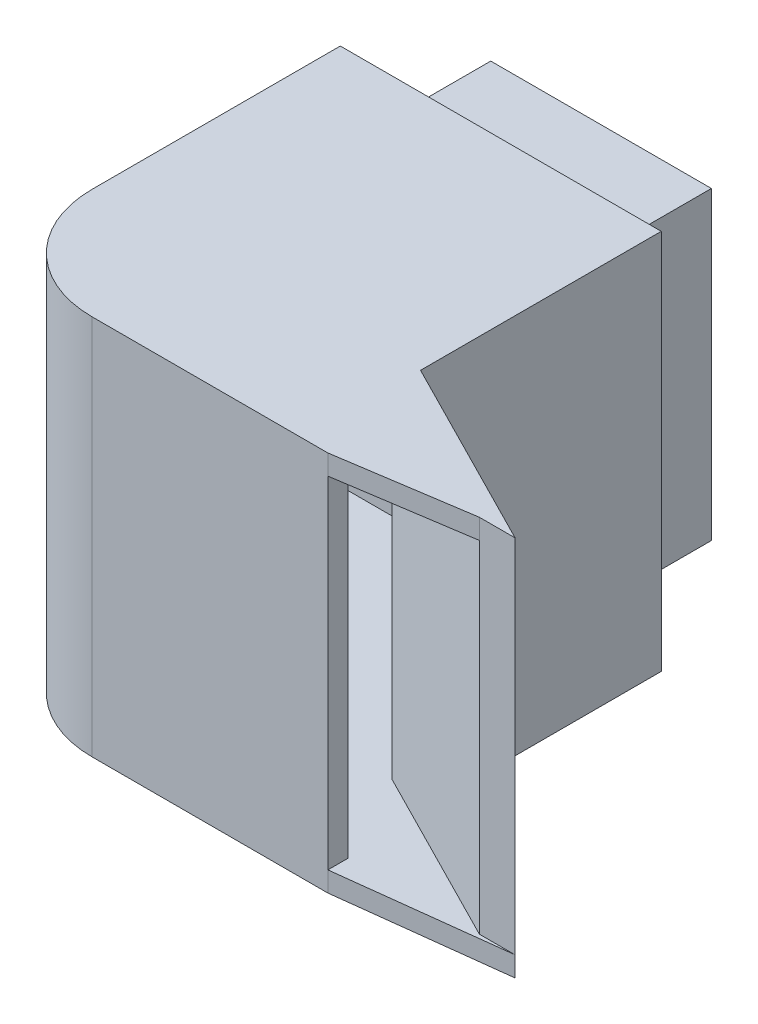
ISO-10303-21;
HEADER;
FILE_DESCRIPTION(('STEP AP214'),'2;1');
FILE_NAME('part.step','',(''),(''),'','','');
FILE_SCHEMA(('AUTOMOTIVE_DESIGN { 1 0 10303 214 1 1 1 1 }'));
ENDSEC;
DATA;
#1=APPLICATION_CONTEXT('core data for automotive mechanical design processes');
#2=APPLICATION_PROTOCOL_DEFINITION('international standard','automotive_design',2000,#1);
#3=PRODUCT_CONTEXT('',#1,'mechanical');
#4=PRODUCT('Part','Part','',(#3));
#5=PRODUCT_RELATED_PRODUCT_CATEGORY('part','',(#4));
#6=PRODUCT_DEFINITION_FORMATION('','',#4);
#7=PRODUCT_DEFINITION_CONTEXT('part definition',#1,'design');
#8=PRODUCT_DEFINITION('design','',#6,#7);
#9=PRODUCT_DEFINITION_SHAPE('','',#8);
#10=(LENGTH_UNIT() NAMED_UNIT(*) SI_UNIT(.MILLI.,.METRE.));
#11=(NAMED_UNIT(*) PLANE_ANGLE_UNIT() SI_UNIT($,.RADIAN.));
#12=(NAMED_UNIT(*) SI_UNIT($,.STERADIAN.) SOLID_ANGLE_UNIT());
#13=UNCERTAINTY_MEASURE_WITH_UNIT(LENGTH_MEASURE(1.E-05),#10,'distance_accuracy_value','');
#14=(GEOMETRIC_REPRESENTATION_CONTEXT(3) GLOBAL_UNCERTAINTY_ASSIGNED_CONTEXT((#13)) GLOBAL_UNIT_ASSIGNED_CONTEXT((#10,
#11,#12)) REPRESENTATION_CONTEXT('',''));
#15=CARTESIAN_POINT('',(0.,0.,0.));
#16=DIRECTION('',(0.,0.,1.));
#17=DIRECTION('',(1.,0.,0.));
#18=AXIS2_PLACEMENT_3D('',#15,#16,#17);
#19=CARTESIAN_POINT('',(-13.0014433254994,19.,-4.91100049947791));
#20=DIRECTION('',(0.,0.,1.));
#21=DIRECTION('',(1.,0.,0.));
#22=AXIS2_PLACEMENT_3D('',#19,#20,#21);
#23=PLANE('',#22);
#24=DIRECTION('',(-1.,0.,0.));
#25=VECTOR('',#24,1.);
#26=CARTESIAN_POINT('',(-13.0014433254994,0.,-4.91100049947791));
#27=LINE('',#26,#25);
#28=CARTESIAN_POINT('',(-13.0014433254994,0.,-4.91100049947791));
#29=VERTEX_POINT('',#28);
#30=CARTESIAN_POINT('',(-29.0014433254994,0.,-4.91100049947791));
#31=VERTEX_POINT('',#30);
#32=EDGE_CURVE('E314',#29,#31,#27,.T.);
#33=ORIENTED_EDGE('',*,*,#32,.T.);
#34=DIRECTION('',(0.,-1.,0.));
#35=VECTOR('',#34,1.);
#36=CARTESIAN_POINT('',(-29.0014433254994,19.,-4.91100049947791));
#37=LINE('',#36,#35);
#38=CARTESIAN_POINT('',(-29.0014433254994,19.,-4.91100049947791));
#39=VERTEX_POINT('',#38);
#40=EDGE_CURVE('E11',#39,#31,#37,.T.);
#41=ORIENTED_EDGE('',*,*,#40,.F.);
#42=DIRECTION('',(-1.,0.,0.));
#43=VECTOR('',#42,1.);
#44=CARTESIAN_POINT('',(-13.0014433254994,19.,-4.91100049947791));
#45=LINE('',#44,#43);
#46=CARTESIAN_POINT('',(-13.0014433254994,19.,-4.91100049947791));
#47=VERTEX_POINT('',#46);
#48=EDGE_CURVE('E315',#47,#39,#45,.T.);
#49=ORIENTED_EDGE('',*,*,#48,.F.);
#50=DIRECTION('',(0.,-1.,0.));
#51=VECTOR('',#50,1.);
#52=CARTESIAN_POINT('',(-13.0014433254994,19.,-4.91100049947791));
#53=LINE('',#52,#51);
#54=EDGE_CURVE('E332',#47,#29,#53,.T.);
#55=ORIENTED_EDGE('',*,*,#54,.T.);
#56=EDGE_LOOP('',(#33,#41,#49,#55));
#57=FACE_BOUND('',#56,.T.);
#58=DIRECTION('',(0.,-1.,0.));
#59=VECTOR('',#58,1.);
#60=CARTESIAN_POINT('',(-15.5014433254994,17.1,-4.91100049947791));
#61=LINE('',#60,#59);
#62=CARTESIAN_POINT('',(-15.5014433254994,17.1,-4.91100049947791));
#63=VERTEX_POINT('',#62);
#64=CARTESIAN_POINT('',(-15.5014433254994,1.9,-4.91100049947791));
#65=VERTEX_POINT('',#64);
#66=EDGE_CURVE('E204',#63,#65,#61,.T.);
#67=ORIENTED_EDGE('',*,*,#66,.F.);
#68=DIRECTION('',(1.,0.,0.));
#69=VECTOR('',#68,1.);
#70=CARTESIAN_POINT('',(-26.5014433254994,17.1,-4.91100049947791));
#71=LINE('',#70,#69);
#72=CARTESIAN_POINT('',(-26.5014433254994,17.1,-4.91100049947791));
#73=VERTEX_POINT('',#72);
#74=EDGE_CURVE('E238',#73,#63,#71,.T.);
#75=ORIENTED_EDGE('',*,*,#74,.F.);
#76=DIRECTION('',(0.,1.,0.));
#77=VECTOR('',#76,1.);
#78=CARTESIAN_POINT('',(-26.5014433254994,17.1,-4.91100049947791));
#79=LINE('',#78,#77);
#80=CARTESIAN_POINT('',(-26.5014433254994,1.90000000000001,-4.91100049947791));
#81=VERTEX_POINT('',#80);
#82=EDGE_CURVE('E248',#81,#73,#79,.T.);
#83=ORIENTED_EDGE('',*,*,#82,.F.);
#84=DIRECTION('',(-1.,0.,0.));
#85=VECTOR('',#84,1.);
#86=CARTESIAN_POINT('',(-26.5014433254994,1.9,-4.91100049947791));
#87=LINE('',#86,#85);
#88=EDGE_CURVE('E57',#65,#81,#87,.T.);
#89=ORIENTED_EDGE('',*,*,#88,.F.);
#90=EDGE_LOOP('',(#67,#75,#83,#89));
#91=FACE_BOUND('',#90,.T.);
#92=ADVANCED_FACE('F35',(#57,#91),#23,.F.);
#93=CARTESIAN_POINT('',(-11.7428727049855,19.,12.9666829371132));
#94=DIRECTION('',(-1.,0.,0.));
#95=DIRECTION('',(0.,0.,1.));
#96=AXIS2_PLACEMENT_3D('',#93,#94,#95);
#97=PLANE('',#96);
#98=DIRECTION('',(0.,0.,1.));
#99=VECTOR('',#98,1.);
#100=CARTESIAN_POINT('',(-11.7428727049855,1.,12.9666829371132));
#101=LINE('',#100,#99);
#102=CARTESIAN_POINT('',(-11.7428727049855,1.,11.9666829371132));
#103=VERTEX_POINT('',#102);
#104=CARTESIAN_POINT('',(-11.7428727049855,1.,12.9666829371132));
#105=VERTEX_POINT('',#104);
#106=EDGE_CURVE('E286',#103,#105,#101,.T.);
#107=ORIENTED_EDGE('',*,*,#106,.F.);
#108=DIRECTION('',(0.,-1.,0.));
#109=VECTOR('',#108,1.);
#110=CARTESIAN_POINT('',(-11.7428727049855,19.,11.9666829371132));
#111=LINE('',#110,#109);
#112=CARTESIAN_POINT('',(-11.7428727049855,18.,11.9666829371132));
#113=VERTEX_POINT('',#112);
#114=EDGE_CURVE('E374',#113,#103,#111,.T.);
#115=ORIENTED_EDGE('',*,*,#114,.F.);
#116=DIRECTION('',(0.,0.,1.));
#117=VECTOR('',#116,1.);
#118=CARTESIAN_POINT('',(-11.7428727049855,18.,12.9666829371132));
#119=LINE('',#118,#117);
#120=CARTESIAN_POINT('',(-11.7428727049855,18.,12.9666829371132));
#121=VERTEX_POINT('',#120);
#122=EDGE_CURVE('E311',#113,#121,#119,.T.);
#123=ORIENTED_EDGE('',*,*,#122,.T.);
#124=DIRECTION('',(0.,-1.,0.));
#125=VECTOR('',#124,1.);
#126=CARTESIAN_POINT('',(-11.7428727049855,19.,12.9666829371132));
#127=LINE('',#126,#125);
#128=EDGE_CURVE('E377',#121,#105,#127,.T.);
#129=ORIENTED_EDGE('',*,*,#128,.T.);
#130=EDGE_LOOP('',(#107,#115,#123,#129));
#131=FACE_BOUND('',#130,.T.);
#132=ADVANCED_FACE('F455',(#131),#97,.F.);
#133=CARTESIAN_POINT('',(-11.7428727049855,19.,11.9666829371132));
#134=DIRECTION('',(0.,0.,1.));
#135=DIRECTION('',(1.,0.,0.));
#136=AXIS2_PLACEMENT_3D('',#133,#134,#135);
#137=PLANE('',#136);
#138=DIRECTION('',(1.,0.,0.));
#139=VECTOR('',#138,1.);
#140=CARTESIAN_POINT('',(-11.7428727049855,1.,11.9666829371132));
#141=LINE('',#140,#139);
#142=CARTESIAN_POINT('',(-23.4876050559901,1.,11.9666829371132));
#143=VERTEX_POINT('',#142);
#144=EDGE_CURVE('E284',#143,#103,#141,.T.);
#145=ORIENTED_EDGE('',*,*,#144,.F.);
#146=DIRECTION('',(0.,-1.,0.));
#147=VECTOR('',#146,1.);
#148=CARTESIAN_POINT('',(-23.4876050559901,19.,11.9666829371132));
#149=LINE('',#148,#147);
#150=CARTESIAN_POINT('',(-23.4876050559901,18.,11.9666829371132));
#151=VERTEX_POINT('',#150);
#152=EDGE_CURVE('E371',#151,#143,#149,.T.);
#153=ORIENTED_EDGE('',*,*,#152,.F.);
#154=DIRECTION('',(1.,0.,0.));
#155=VECTOR('',#154,1.);
#156=CARTESIAN_POINT('',(-11.7428727049855,18.,11.9666829371132));
#157=LINE('',#156,#155);
#158=EDGE_CURVE('E308',#151,#113,#157,.T.);
#159=ORIENTED_EDGE('',*,*,#158,.T.);
#160=ORIENTED_EDGE('',*,*,#114,.T.);
#161=EDGE_LOOP('',(#145,#153,#159,#160));
#162=FACE_BOUND('',#161,.T.);
#163=ADVANCED_FACE('F451',(#162),#137,.F.);
#164=CARTESIAN_POINT('',(-23.4876050559901,19.,7.45284466760389));
#165=DIRECTION('',(0.,-1.,0.));
#166=DIRECTION('',(0.,0.,-1.));
#167=AXIS2_PLACEMENT_3D('',#164,#165,#166);
#168=CYLINDRICAL_SURFACE('',#167,4.51383826950932);
#169=CARTESIAN_POINT('',(-23.4876050559901,1.,7.45284466760389));
#170=DIRECTION('',(0.,-1.,0.));
#171=DIRECTION('',(0.,0.,-1.));
#172=AXIS2_PLACEMENT_3D('',#169,#170,#171);
#173=CIRCLE('',#172,4.51383826950932);
#174=CARTESIAN_POINT('',(-28.0014433254994,1.,7.45284466760389));
#175=VERTEX_POINT('',#174);
#176=EDGE_CURVE('E282',#175,#143,#173,.F.);
#177=ORIENTED_EDGE('',*,*,#176,.F.);
#178=DIRECTION('',(0.,-1.,0.));
#179=VECTOR('',#178,1.);
#180=CARTESIAN_POINT('',(-28.0014433254994,19.,7.45284466760389));
#181=LINE('',#180,#179);
#182=CARTESIAN_POINT('',(-28.0014433254994,18.,7.45284466760389));
#183=VERTEX_POINT('',#182);
#184=EDGE_CURVE('E368',#183,#175,#181,.T.);
#185=ORIENTED_EDGE('',*,*,#184,.F.);
#186=CARTESIAN_POINT('',(-23.4876050559901,18.,7.45284466760389));
#187=DIRECTION('',(0.,-1.,0.));
#188=DIRECTION('',(0.,0.,-1.));
#189=AXIS2_PLACEMENT_3D('',#186,#187,#188);
#190=CIRCLE('',#189,4.51383826950932);
#191=EDGE_CURVE('E305',#183,#151,#190,.F.);
#192=ORIENTED_EDGE('',*,*,#191,.T.);
#193=ORIENTED_EDGE('',*,*,#152,.T.);
#194=EDGE_LOOP('',(#177,#185,#192,#193));
#195=FACE_BOUND('',#194,.T.);
#196=ADVANCED_FACE('F448',(#195),#168,.F.);
#197=CARTESIAN_POINT('',(-28.0014433254994,19.,7.45284466760389));
#198=DIRECTION('',(-1.,0.,0.));
#199=DIRECTION('',(0.,0.,1.));
#200=AXIS2_PLACEMENT_3D('',#197,#198,#199);
#201=PLANE('',#200);
#202=DIRECTION('',(0.,0.,1.));
#203=VECTOR('',#202,1.);
#204=CARTESIAN_POINT('',(-28.0014433254994,1.,7.45284466760389));
#205=LINE('',#204,#203);
#206=CARTESIAN_POINT('',(-28.0014433254994,1.,-3.91100049947791));
#207=VERTEX_POINT('',#206);
#208=EDGE_CURVE('E280',#207,#175,#205,.T.);
#209=ORIENTED_EDGE('',*,*,#208,.F.);
#210=DIRECTION('',(0.,-1.,0.));
#211=VECTOR('',#210,1.);
#212=CARTESIAN_POINT('',(-28.0014433254994,19.,-3.91100049947791));
#213=LINE('',#212,#211);
#214=CARTESIAN_POINT('',(-28.0014433254994,18.,-3.91100049947791));
#215=VERTEX_POINT('',#214);
#216=EDGE_CURVE('E365',#215,#207,#213,.T.);
#217=ORIENTED_EDGE('',*,*,#216,.F.);
#218=DIRECTION('',(0.,0.,1.));
#219=VECTOR('',#218,1.);
#220=CARTESIAN_POINT('',(-28.0014433254994,18.,7.45284466760389));
#221=LINE('',#220,#219);
#222=EDGE_CURVE('E302',#215,#183,#221,.T.);
#223=ORIENTED_EDGE('',*,*,#222,.T.);
#224=ORIENTED_EDGE('',*,*,#184,.T.);
#225=EDGE_LOOP('',(#209,#217,#223,#224));
#226=FACE_BOUND('',#225,.T.);
#227=ADVANCED_FACE('F443',(#226),#201,.F.);
#228=CARTESIAN_POINT('',(-28.0014433254994,19.,-3.91100049947791));
#229=DIRECTION('',(0.,0.,-1.));
#230=DIRECTION('',(-1.,0.,0.));
#231=AXIS2_PLACEMENT_3D('',#228,#229,#230);
#232=PLANE('',#231);
#233=DIRECTION('',(-1.,0.,0.));
#234=VECTOR('',#233,1.);
#235=CARTESIAN_POINT('',(-28.0014433254994,2.9,-3.91100049947791));
#236=LINE('',#235,#234);
#237=CARTESIAN_POINT('',(-16.5014433254994,2.9,-3.9110004994779));
#238=VERTEX_POINT('',#237);
#239=CARTESIAN_POINT('',(-25.5014433254994,2.9,-3.9110004994779));
#240=VERTEX_POINT('',#239);
#241=EDGE_CURVE('E216',#238,#240,#236,.T.);
#242=ORIENTED_EDGE('',*,*,#241,.T.);
#243=DIRECTION('',(0.,1.,0.));
#244=VECTOR('',#243,1.);
#245=CARTESIAN_POINT('',(-25.5014433254994,19.,-3.91100049947791));
#246=LINE('',#245,#244);
#247=CARTESIAN_POINT('',(-25.5014433254994,16.1,-3.9110004994779));
#248=VERTEX_POINT('',#247);
#249=EDGE_CURVE('E199',#240,#248,#246,.T.);
#250=ORIENTED_EDGE('',*,*,#249,.T.);
#251=DIRECTION('',(1.,0.,0.));
#252=VECTOR('',#251,1.);
#253=CARTESIAN_POINT('',(-28.0014433254994,16.1,-3.91100049947791));
#254=LINE('',#253,#252);
#255=CARTESIAN_POINT('',(-16.5014433254994,16.1,-3.91100049947791));
#256=VERTEX_POINT('',#255);
#257=EDGE_CURVE('E207',#248,#256,#254,.T.);
#258=ORIENTED_EDGE('',*,*,#257,.T.);
#259=DIRECTION('',(0.,-1.,0.));
#260=VECTOR('',#259,1.);
#261=CARTESIAN_POINT('',(-16.5014433254994,19.,-3.91100049947791));
#262=LINE('',#261,#260);
#263=EDGE_CURVE('E211',#256,#238,#262,.T.);
#264=ORIENTED_EDGE('',*,*,#263,.T.);
#265=EDGE_LOOP('',(#242,#250,#258,#264));
#266=FACE_BOUND('',#265,.T.);
#267=DIRECTION('',(-1.,0.,0.));
#268=VECTOR('',#267,1.);
#269=CARTESIAN_POINT('',(-28.0014433254994,1.,-3.91100049947791));
#270=LINE('',#269,#268);
#271=CARTESIAN_POINT('',(-14.0670678807808,1.,-3.91100049947791));
#272=VERTEX_POINT('',#271);
#273=EDGE_CURVE('E278',#272,#207,#270,.T.);
#274=ORIENTED_EDGE('',*,*,#273,.F.);
#275=DIRECTION('',(0.,-1.,0.));
#276=VECTOR('',#275,1.);
#277=CARTESIAN_POINT('',(-14.0670678807808,19.,-3.91100049947791));
#278=LINE('',#277,#276);
#279=CARTESIAN_POINT('',(-14.0670678807808,18.,-3.91100049947791));
#280=VERTEX_POINT('',#279);
#281=EDGE_CURVE('E362',#280,#272,#278,.T.);
#282=ORIENTED_EDGE('',*,*,#281,.F.);
#283=DIRECTION('',(-1.,0.,0.));
#284=VECTOR('',#283,1.);
#285=CARTESIAN_POINT('',(-28.0014433254994,18.,-3.91100049947791));
#286=LINE('',#285,#284);
#287=EDGE_CURVE('E299',#280,#215,#286,.T.);
#288=ORIENTED_EDGE('',*,*,#287,.T.);
#289=ORIENTED_EDGE('',*,*,#216,.T.);
#290=EDGE_LOOP('',(#274,#282,#288,#289));
#291=FACE_BOUND('',#290,.T.);
#292=ADVANCED_FACE('F213',(#266,#291),#232,.F.);
#293=CARTESIAN_POINT('',(-14.0670678807808,19.,-3.91100049947791));
#294=DIRECTION('',(1.,0.,0.));
#295=DIRECTION('',(0.,0.,-1.));
#296=AXIS2_PLACEMENT_3D('',#293,#294,#295);
#297=PLANE('',#296);
#298=DIRECTION('',(0.,0.,-1.));
#299=VECTOR('',#298,1.);
#300=CARTESIAN_POINT('',(-14.0670678807808,1.,-3.91100049947791));
#301=LINE('',#300,#299);
#302=CARTESIAN_POINT('',(-14.0670678807808,1.,7.45284466760389));
#303=VERTEX_POINT('',#302);
#304=EDGE_CURVE('E276',#303,#272,#301,.T.);
#305=ORIENTED_EDGE('',*,*,#304,.F.);
#306=DIRECTION('',(0.,-1.,0.));
#307=VECTOR('',#306,1.);
#308=CARTESIAN_POINT('',(-14.0670678807808,19.,7.45284466760389));
#309=LINE('',#308,#307);
#310=CARTESIAN_POINT('',(-14.0670678807808,18.,7.45284466760389));
#311=VERTEX_POINT('',#310);
#312=EDGE_CURVE('E359',#311,#303,#309,.T.);
#313=ORIENTED_EDGE('',*,*,#312,.F.);
#314=DIRECTION('',(0.,0.,-1.));
#315=VECTOR('',#314,1.);
#316=CARTESIAN_POINT('',(-14.0670678807808,18.,-3.91100049947791));
#317=LINE('',#316,#315);
#318=EDGE_CURVE('E296',#311,#280,#317,.T.);
#319=ORIENTED_EDGE('',*,*,#318,.T.);
#320=ORIENTED_EDGE('',*,*,#281,.T.);
#321=EDGE_LOOP('',(#305,#313,#319,#320));
#322=FACE_BOUND('',#321,.T.);
#323=ADVANCED_FACE('F437',(#322),#297,.F.);
#324=CARTESIAN_POINT('',(-14.0670678807808,19.,7.45284466760389));
#325=DIRECTION('',(0.453246735020218,0.,-0.891385100387881));
#326=DIRECTION('',(-0.891385100387881,0.,-0.453246735020218));
#327=AXIS2_PLACEMENT_3D('',#324,#325,#326);
#328=PLANE('',#327);
#329=DIRECTION('',(-0.891385100387881,0.,-0.453246735020218));
#330=VECTOR('',#329,1.);
#331=CARTESIAN_POINT('',(-14.0670678807808,1.,7.45284466760389));
#332=LINE('',#331,#330);
#333=CARTESIAN_POINT('',(-5.18985406296535,1.,11.9666829371132));
#334=VERTEX_POINT('',#333);
#335=EDGE_CURVE('E274',#334,#303,#332,.T.);
#336=ORIENTED_EDGE('',*,*,#335,.F.);
#337=DIRECTION('',(0.,-1.,0.));
#338=VECTOR('',#337,1.);
#339=CARTESIAN_POINT('',(-5.18985406296535,19.,11.9666829371132));
#340=LINE('',#339,#338);
#341=CARTESIAN_POINT('',(-5.18985406296535,18.,11.9666829371132));
#342=VERTEX_POINT('',#341);
#343=EDGE_CURVE('E355',#342,#334,#340,.T.);
#344=ORIENTED_EDGE('',*,*,#343,.F.);
#345=DIRECTION('',(-0.891385100387881,0.,-0.453246735020218));
#346=VECTOR('',#345,1.);
#347=CARTESIAN_POINT('',(-14.0670678807808,18.,7.45284466760389));
#348=LINE('',#347,#346);
#349=EDGE_CURVE('E291',#342,#311,#348,.T.);
#350=ORIENTED_EDGE('',*,*,#349,.T.);
#351=ORIENTED_EDGE('',*,*,#312,.T.);
#352=EDGE_LOOP('',(#336,#344,#350,#351));
#353=FACE_BOUND('',#352,.T.);
#354=ADVANCED_FACE('F433',(#353),#328,.F.);
#355=CARTESIAN_POINT('',(-5.18985406296535,19.,11.9666829371132));
#356=DIRECTION('',(0.,0.,-1.));
#357=DIRECTION('',(-1.,0.,0.));
#358=AXIS2_PLACEMENT_3D('',#355,#356,#357);
#359=PLANE('',#358);
#360=DIRECTION('',(-1.,0.,0.));
#361=VECTOR('',#360,1.);
#362=CARTESIAN_POINT('',(-5.18985406296535,1.,11.9666829371132));
#363=LINE('',#362,#361);
#364=CARTESIAN_POINT('',(-3.40866746227748,1.,11.9666829371132));
#365=VERTEX_POINT('',#364);
#366=EDGE_CURVE('E270',#365,#334,#363,.T.);
#367=ORIENTED_EDGE('',*,*,#366,.F.);
#368=DIRECTION('',(0.,-1.,0.));
#369=VECTOR('',#368,1.);
#370=CARTESIAN_POINT('',(-3.40866746227748,19.,11.9666829371132));
#371=LINE('',#370,#369);
#372=CARTESIAN_POINT('',(-3.40866746227748,19.,11.9666829371132));
#373=VERTEX_POINT('',#372);
#374=EDGE_CURVE('E352',#373,#365,#371,.T.);
#375=ORIENTED_EDGE('',*,*,#374,.F.);
#376=DIRECTION('',(1.,0.,0.));
#377=VECTOR('',#376,1.);
#378=CARTESIAN_POINT('',(-5.18985406296535,19.,11.9666829371132));
#379=LINE('',#378,#377);
#380=CARTESIAN_POINT('',(-5.18985406296535,19.,11.9666829371132));
#381=VERTEX_POINT('',#380);
#382=EDGE_CURVE('E326',#381,#373,#379,.T.);
#383=ORIENTED_EDGE('',*,*,#382,.F.);
#384=EDGE_CURVE('E356',#381,#342,#340,.T.);
#385=ORIENTED_EDGE('',*,*,#384,.T.);
#386=ORIENTED_EDGE('',*,*,#343,.T.);
#387=EDGE_LOOP('',(#367,#375,#383,#385,#386));
#388=FACE_BOUND('',#387,.T.);
#389=ADVANCED_FACE('F426',(#388),#359,.F.);
#390=CARTESIAN_POINT('',(-29.0014433254994,19.,-4.91100049947791));
#391=DIRECTION('',(1.,0.,0.));
#392=DIRECTION('',(0.,0.,-1.));
#393=AXIS2_PLACEMENT_3D('',#390,#391,#392);
#394=PLANE('',#393);
#395=DIRECTION('',(0.,0.,1.));
#396=VECTOR('',#395,1.);
#397=CARTESIAN_POINT('',(-29.0014433254994,0.,-4.91100049947791));
#398=LINE('',#397,#396);
#399=CARTESIAN_POINT('',(-29.0014433254994,0.,7.45983090895021));
#400=VERTEX_POINT('',#399);
#401=EDGE_CURVE('E335',#31,#400,#398,.T.);
#402=ORIENTED_EDGE('',*,*,#401,.T.);
#403=DIRECTION('',(0.,-1.,0.));
#404=VECTOR('',#403,1.);
#405=CARTESIAN_POINT('',(-29.0014433254994,19.,7.45983090895021));
#406=LINE('',#405,#404);
#407=CARTESIAN_POINT('',(-29.0014433254994,19.,7.45983090895021));
#408=VERTEX_POINT('',#407);
#409=EDGE_CURVE('E42',#408,#400,#406,.T.);
#410=ORIENTED_EDGE('',*,*,#409,.F.);
#411=DIRECTION('',(0.,0.,1.));
#412=VECTOR('',#411,1.);
#413=CARTESIAN_POINT('',(-29.0014433254994,19.,-4.91100049947791));
#414=LINE('',#413,#412);
#415=EDGE_CURVE('E318',#39,#408,#414,.T.);
#416=ORIENTED_EDGE('',*,*,#415,.F.);
#417=ORIENTED_EDGE('',*,*,#40,.T.);
#418=EDGE_LOOP('',(#402,#410,#416,#417));
#419=FACE_BOUND('',#418,.T.);
#420=ADVANCED_FACE('F390',(#419),#394,.F.);
#421=CARTESIAN_POINT('',(-23.4945912973364,19.,7.45983090895021));
#422=DIRECTION('',(0.,-1.,0.));
#423=DIRECTION('',(0.,0.,-1.));
#424=AXIS2_PLACEMENT_3D('',#421,#422,#423);
#425=CYLINDRICAL_SURFACE('',#424,5.506852028163);
#426=CARTESIAN_POINT('',(-23.4945912973364,0.,7.45983090895021));
#427=DIRECTION('',(0.,1.,0.));
#428=DIRECTION('',(0.,0.,1.));
#429=AXIS2_PLACEMENT_3D('',#426,#427,#428);
#430=CIRCLE('',#429,5.506852028163);
#431=CARTESIAN_POINT('',(-23.4945912973364,0.,12.9666829371132));
#432=VERTEX_POINT('',#431);
#433=EDGE_CURVE('E338',#400,#432,#430,.T.);
#434=ORIENTED_EDGE('',*,*,#433,.T.);
#435=DIRECTION('',(0.,-1.,0.));
#436=VECTOR('',#435,1.);
#437=CARTESIAN_POINT('',(-23.4945912973364,19.,12.9666829371132));
#438=LINE('',#437,#436);
#439=CARTESIAN_POINT('',(-23.4945912973364,19.,12.9666829371132));
#440=VERTEX_POINT('',#439);
#441=EDGE_CURVE('E380',#440,#432,#438,.T.);
#442=ORIENTED_EDGE('',*,*,#441,.F.);
#443=CARTESIAN_POINT('',(-23.4945912973364,19.,7.45983090895021));
#444=DIRECTION('',(0.,1.,0.));
#445=DIRECTION('',(0.,0.,1.));
#446=AXIS2_PLACEMENT_3D('',#443,#444,#445);
#447=CIRCLE('',#446,5.506852028163);
#448=EDGE_CURVE('E321',#408,#440,#447,.T.);
#449=ORIENTED_EDGE('',*,*,#448,.F.);
#450=ORIENTED_EDGE('',*,*,#409,.T.);
#451=EDGE_LOOP('',(#434,#442,#449,#450));
#452=FACE_BOUND('',#451,.T.);
#453=ADVANCED_FACE('F384',(#452),#425,.T.);
#454=CARTESIAN_POINT('',(-23.4945912973364,19.,12.9666829371132));
#455=DIRECTION('',(0.,0.,-1.));
#456=DIRECTION('',(-1.,0.,0.));
#457=AXIS2_PLACEMENT_3D('',#454,#455,#456);
#458=PLANE('',#457);
#459=DIRECTION('',(0.,-1.,0.));
#460=VECTOR('',#459,1.);
#461=CARTESIAN_POINT('',(-11.7428727049855,1.,12.9666829371132));
#462=LINE('',#461,#460);
#463=CARTESIAN_POINT('',(-11.7428727049855,0.,12.9666829371132));
#464=VERTEX_POINT('',#463);
#465=EDGE_CURVE('E268',#105,#464,#462,.T.);
#466=ORIENTED_EDGE('',*,*,#465,.F.);
#467=ORIENTED_EDGE('',*,*,#128,.F.);
#468=CARTESIAN_POINT('',(-11.7428727049855,19.,12.9666829371132));
#469=VERTEX_POINT('',#468);
#470=EDGE_CURVE('E378',#469,#121,#127,.T.);
#471=ORIENTED_EDGE('',*,*,#470,.F.);
#472=DIRECTION('',(1.,0.,0.));
#473=VECTOR('',#472,1.);
#474=CARTESIAN_POINT('',(-23.4945912973364,19.,12.9666829371132));
#475=LINE('',#474,#473);
#476=EDGE_CURVE('E323',#440,#469,#475,.T.);
#477=ORIENTED_EDGE('',*,*,#476,.F.);
#478=ORIENTED_EDGE('',*,*,#441,.T.);
#479=DIRECTION('',(1.,0.,0.));
#480=VECTOR('',#479,1.);
#481=CARTESIAN_POINT('',(-23.4945912973364,0.,12.9666829371132));
#482=LINE('',#481,#480);
#483=EDGE_CURVE('E341',#432,#464,#482,.T.);
#484=ORIENTED_EDGE('',*,*,#483,.T.);
#485=EDGE_LOOP('',(#466,#467,#471,#477,#478,#484));
#486=FACE_BOUND('',#485,.T.);
#487=ADVANCED_FACE('F399',(#486),#458,.F.);
#488=CARTESIAN_POINT('',(-13.0014433254994,19.,7.08899950052209));
#489=DIRECTION('',(-0.453246735020218,0.,0.891385100387881));
#490=DIRECTION('',(0.891385100387881,0.,0.453246735020218));
#491=AXIS2_PLACEMENT_3D('',#488,#489,#490);
#492=PLANE('',#491);
#493=DIRECTION('',(-0.891385100387881,0.,-0.453246735020218));
#494=VECTOR('',#493,1.);
#495=CARTESIAN_POINT('',(-13.0014433254994,0.,7.08899950052209));
#496=LINE('',#495,#494);
#497=CARTESIAN_POINT('',(-3.40866746227748,0.,11.9666829371132));
#498=VERTEX_POINT('',#497);
#499=CARTESIAN_POINT('',(-13.0014433254994,0.,7.08899950052209));
#500=VERTEX_POINT('',#499);
#501=EDGE_CURVE('E344',#498,#500,#496,.T.);
#502=ORIENTED_EDGE('',*,*,#501,.T.);
#503=DIRECTION('',(0.,-1.,0.));
#504=VECTOR('',#503,1.);
#505=CARTESIAN_POINT('',(-13.0014433254994,19.,7.08899950052209));
#506=LINE('',#505,#504);
#507=CARTESIAN_POINT('',(-13.0014433254994,19.,7.08899950052209));
#508=VERTEX_POINT('',#507);
#509=EDGE_CURVE('E350',#508,#500,#506,.T.);
#510=ORIENTED_EDGE('',*,*,#509,.F.);
#511=DIRECTION('',(-0.891385100387881,0.,-0.453246735020218));
#512=VECTOR('',#511,1.);
#513=CARTESIAN_POINT('',(-13.0014433254994,19.,7.08899950052209));
#514=LINE('',#513,#512);
#515=EDGE_CURVE('E328',#373,#508,#514,.T.);
#516=ORIENTED_EDGE('',*,*,#515,.F.);
#517=ORIENTED_EDGE('',*,*,#374,.T.);
#518=DIRECTION('',(0.,-1.,0.));
#519=VECTOR('',#518,1.);
#520=CARTESIAN_POINT('',(-3.40866746227748,1.,11.9666829371132));
#521=LINE('',#520,#519);
#522=EDGE_CURVE('E266',#365,#498,#521,.T.);
#523=ORIENTED_EDGE('',*,*,#522,.T.);
#524=EDGE_LOOP('',(#502,#510,#516,#517,#523));
#525=FACE_BOUND('',#524,.T.);
#526=ADVANCED_FACE('F417',(#525),#492,.F.);
#527=CARTESIAN_POINT('',(-13.0014433254994,19.,-4.91100049947791));
#528=DIRECTION('',(-1.,0.,0.));
#529=DIRECTION('',(0.,0.,1.));
#530=AXIS2_PLACEMENT_3D('',#527,#528,#529);
#531=PLANE('',#530);
#532=DIRECTION('',(0.,0.,-1.));
#533=VECTOR('',#532,1.);
#534=CARTESIAN_POINT('',(-13.0014433254994,0.,-4.91100049947791));
#535=LINE('',#534,#533);
#536=EDGE_CURVE('E319',#500,#29,#535,.T.);
#537=ORIENTED_EDGE('',*,*,#536,.T.);
#538=ORIENTED_EDGE('',*,*,#54,.F.);
#539=DIRECTION('',(0.,0.,-1.));
#540=VECTOR('',#539,1.);
#541=CARTESIAN_POINT('',(-13.0014433254994,19.,-4.91100049947791));
#542=LINE('',#541,#540);
#543=EDGE_CURVE('E330',#508,#47,#542,.T.);
#544=ORIENTED_EDGE('',*,*,#543,.F.);
#545=ORIENTED_EDGE('',*,*,#509,.T.);
#546=EDGE_LOOP('',(#537,#538,#544,#545));
#547=FACE_BOUND('',#546,.T.);
#548=ADVANCED_FACE('F413',(#547),#531,.F.);
#549=CARTESIAN_POINT('',(-23.4945912973364,19.,7.45983090895021));
#550=DIRECTION('',(0.,1.,0.));
#551=DIRECTION('',(0.,0.,1.));
#552=AXIS2_PLACEMENT_3D('',#549,#550,#551);
#553=PLANE('',#552);
#554=ORIENTED_EDGE('',*,*,#48,.T.);
#555=ORIENTED_EDGE('',*,*,#415,.T.);
#556=ORIENTED_EDGE('',*,*,#448,.T.);
#557=ORIENTED_EDGE('',*,*,#476,.T.);
#558=DIRECTION('',(0.988555894559004,0.,-0.150855040792964));
#559=VECTOR('',#558,1.);
#560=CARTESIAN_POINT('',(-5.18985406296535,19.,11.9666829371132));
#561=LINE('',#560,#559);
#562=EDGE_CURVE('E288',#469,#381,#561,.T.);
#563=ORIENTED_EDGE('',*,*,#562,.T.);
#564=ORIENTED_EDGE('',*,*,#382,.T.);
#565=ORIENTED_EDGE('',*,*,#515,.T.);
#566=ORIENTED_EDGE('',*,*,#543,.T.);
#567=EDGE_LOOP('',(#554,#555,#556,#557,#563,#564,#565,#566));
#568=FACE_BOUND('',#567,.T.);
#569=ADVANCED_FACE('F405',(#568),#553,.T.);
#570=CARTESIAN_POINT('',(-23.4945912973364,0.,7.45983090895021));
#571=DIRECTION('',(0.,1.,0.));
#572=DIRECTION('',(0.,0.,1.));
#573=AXIS2_PLACEMENT_3D('',#570,#571,#572);
#574=PLANE('',#573);
#575=ORIENTED_EDGE('',*,*,#32,.F.);
#576=ORIENTED_EDGE('',*,*,#536,.F.);
#577=ORIENTED_EDGE('',*,*,#501,.F.);
#578=DIRECTION('',(0.992878312950457,0.,-0.119132932779544));
#579=VECTOR('',#578,1.);
#580=CARTESIAN_POINT('',(1.36709512788312,0.,11.3936513820841));
#581=LINE('',#580,#579);
#582=EDGE_CURVE('E263',#464,#498,#581,.T.);
#583=ORIENTED_EDGE('',*,*,#582,.F.);
#584=ORIENTED_EDGE('',*,*,#483,.F.);
#585=ORIENTED_EDGE('',*,*,#433,.F.);
#586=ORIENTED_EDGE('',*,*,#401,.F.);
#587=EDGE_LOOP('',(#575,#576,#577,#583,#584,#585,#586));
#588=FACE_BOUND('',#587,.T.);
#589=ADVANCED_FACE('F394',(#588),#574,.F.);
#590=CARTESIAN_POINT('',(-23.4945912973364,18.,7.45983090895021));
#591=DIRECTION('',(0.,-1.,0.));
#592=DIRECTION('',(0.,0.,-1.));
#593=AXIS2_PLACEMENT_3D('',#590,#591,#592);
#594=PLANE('',#593);
#595=ORIENTED_EDGE('',*,*,#122,.F.);
#596=ORIENTED_EDGE('',*,*,#158,.F.);
#597=ORIENTED_EDGE('',*,*,#191,.F.);
#598=ORIENTED_EDGE('',*,*,#222,.F.);
#599=ORIENTED_EDGE('',*,*,#287,.F.);
#600=ORIENTED_EDGE('',*,*,#318,.F.);
#601=ORIENTED_EDGE('',*,*,#349,.F.);
#602=DIRECTION('',(0.988555894559004,0.,-0.150855040792964));
#603=VECTOR('',#602,1.);
#604=CARTESIAN_POINT('',(-5.18985406296535,18.,11.9666829371132));
#605=LINE('',#604,#603);
#606=EDGE_CURVE('E289',#121,#342,#605,.T.);
#607=ORIENTED_EDGE('',*,*,#606,.F.);
#608=EDGE_LOOP('',(#595,#596,#597,#598,#599,#600,#601,#607));
#609=FACE_BOUND('',#608,.T.);
#610=ADVANCED_FACE('F458',(#609),#594,.T.);
#611=CARTESIAN_POINT('',(-5.18985406296535,18.,11.9666829371132));
#612=DIRECTION('',(0.150855040792964,0.,0.988555894559004));
#613=DIRECTION('',(0.988555894559004,0.,-0.150855040792964));
#614=AXIS2_PLACEMENT_3D('',#611,#612,#613);
#615=PLANE('',#614);
#616=ORIENTED_EDGE('',*,*,#562,.F.);
#617=ORIENTED_EDGE('',*,*,#470,.T.);
#618=ORIENTED_EDGE('',*,*,#606,.T.);
#619=ORIENTED_EDGE('',*,*,#384,.F.);
#620=EDGE_LOOP('',(#616,#617,#618,#619));
#621=FACE_BOUND('',#620,.T.);
#622=ADVANCED_FACE('F460',(#621),#615,.T.);
#623=CARTESIAN_POINT('',(0.,1.,0.));
#624=DIRECTION('',(0.,-1.,0.));
#625=DIRECTION('',(0.,0.,-1.));
#626=AXIS2_PLACEMENT_3D('',#623,#624,#625);
#627=PLANE('',#626);
#628=ORIENTED_EDGE('',*,*,#144,.T.);
#629=ORIENTED_EDGE('',*,*,#106,.T.);
#630=DIRECTION('',(0.992878312950457,0.,-0.119132932779544));
#631=VECTOR('',#630,1.);
#632=CARTESIAN_POINT('',(1.36709512788312,1.,11.3936513820841));
#633=LINE('',#632,#631);
#634=EDGE_CURVE('E264',#105,#365,#633,.T.);
#635=ORIENTED_EDGE('',*,*,#634,.T.);
#636=ORIENTED_EDGE('',*,*,#366,.T.);
#637=ORIENTED_EDGE('',*,*,#335,.T.);
#638=ORIENTED_EDGE('',*,*,#304,.T.);
#639=ORIENTED_EDGE('',*,*,#273,.T.);
#640=ORIENTED_EDGE('',*,*,#208,.T.);
#641=ORIENTED_EDGE('',*,*,#176,.T.);
#642=EDGE_LOOP('',(#628,#629,#635,#636,#637,#638,#639,#640,#641));
#643=FACE_BOUND('',#642,.T.);
#644=ADVANCED_FACE('F430',(#643),#627,.F.);
#645=CARTESIAN_POINT('',(1.36709512788312,1.,11.3936513820841));
#646=DIRECTION('',(-0.119132932779543,0.,-0.992878312950457));
#647=DIRECTION('',(-0.992878312950457,0.,0.119132932779543));
#648=AXIS2_PLACEMENT_3D('',#645,#646,#647);
#649=PLANE('',#648);
#650=ORIENTED_EDGE('',*,*,#582,.T.);
#651=ORIENTED_EDGE('',*,*,#522,.F.);
#652=ORIENTED_EDGE('',*,*,#634,.F.);
#653=ORIENTED_EDGE('',*,*,#465,.T.);
#654=EDGE_LOOP('',(#650,#651,#652,#653));
#655=FACE_BOUND('',#654,.T.);
#656=ADVANCED_FACE('F423',(#655),#649,.F.);
#657=CARTESIAN_POINT('',(0.,0.,-9.91100049947791));
#658=DIRECTION('',(0.,0.,1.));
#659=DIRECTION('',(1.,0.,0.));
#660=AXIS2_PLACEMENT_3D('',#657,#658,#659);
#661=PLANE('',#660);
#662=DIRECTION('',(0.,-1.,0.));
#663=VECTOR('',#662,1.);
#664=CARTESIAN_POINT('',(-15.5014433254994,17.1,-9.91100049947791));
#665=LINE('',#664,#663);
#666=CARTESIAN_POINT('',(-15.5014433254994,17.1,-9.91100049947791));
#667=VERTEX_POINT('',#666);
#668=CARTESIAN_POINT('',(-15.5014433254994,1.9,-9.91100049947791));
#669=VERTEX_POINT('',#668);
#670=EDGE_CURVE('E234',#667,#669,#665,.T.);
#671=ORIENTED_EDGE('',*,*,#670,.T.);
#672=DIRECTION('',(-1.,0.,0.));
#673=VECTOR('',#672,1.);
#674=CARTESIAN_POINT('',(-26.5014433254994,1.9,-9.91100049947791));
#675=LINE('',#674,#673);
#676=CARTESIAN_POINT('',(-26.5014433254994,1.9,-9.91100049947791));
#677=VERTEX_POINT('',#676);
#678=EDGE_CURVE('E237',#669,#677,#675,.T.);
#679=ORIENTED_EDGE('',*,*,#678,.T.);
#680=DIRECTION('',(0.,1.,0.));
#681=VECTOR('',#680,1.);
#682=CARTESIAN_POINT('',(-26.5014433254994,17.1,-9.91100049947791));
#683=LINE('',#682,#681);
#684=CARTESIAN_POINT('',(-26.5014433254994,17.1,-9.91100049947791));
#685=VERTEX_POINT('',#684);
#686=EDGE_CURVE('E240',#677,#685,#683,.T.);
#687=ORIENTED_EDGE('',*,*,#686,.T.);
#688=DIRECTION('',(1.,0.,0.));
#689=VECTOR('',#688,1.);
#690=CARTESIAN_POINT('',(-26.5014433254994,17.1,-9.91100049947791));
#691=LINE('',#690,#689);
#692=EDGE_CURVE('E242',#685,#667,#691,.T.);
#693=ORIENTED_EDGE('',*,*,#692,.T.);
#694=EDGE_LOOP('',(#671,#679,#687,#693));
#695=FACE_BOUND('',#694,.T.);
#696=DIRECTION('',(0.,1.,0.));
#697=VECTOR('',#696,1.);
#698=CARTESIAN_POINT('',(-25.5014433254994,2.9,-9.91100049947791));
#699=LINE('',#698,#697);
#700=CARTESIAN_POINT('',(-25.5014433254994,2.9,-9.91100049947791));
#701=VERTEX_POINT('',#700);
#702=CARTESIAN_POINT('',(-25.5014433254994,16.1,-9.91100049947791));
#703=VERTEX_POINT('',#702);
#704=EDGE_CURVE('E202',#701,#703,#699,.T.);
#705=ORIENTED_EDGE('',*,*,#704,.F.);
#706=DIRECTION('',(-1.,0.,0.));
#707=VECTOR('',#706,1.);
#708=CARTESIAN_POINT('',(-25.5014433254994,2.9,-9.91100049947791));
#709=LINE('',#708,#707);
#710=CARTESIAN_POINT('',(-16.5014433254994,2.9,-9.91100049947791));
#711=VERTEX_POINT('',#710);
#712=EDGE_CURVE('E227',#711,#701,#709,.T.);
#713=ORIENTED_EDGE('',*,*,#712,.F.);
#714=DIRECTION('',(0.,-1.,0.));
#715=VECTOR('',#714,1.);
#716=CARTESIAN_POINT('',(-16.5014433254994,2.9,-9.91100049947791));
#717=LINE('',#716,#715);
#718=CARTESIAN_POINT('',(-16.5014433254994,16.1,-9.91100049947791));
#719=VERTEX_POINT('',#718);
#720=EDGE_CURVE('E224',#719,#711,#717,.T.);
#721=ORIENTED_EDGE('',*,*,#720,.F.);
#722=DIRECTION('',(1.,0.,0.));
#723=VECTOR('',#722,1.);
#724=CARTESIAN_POINT('',(-25.5014433254994,16.1,-9.91100049947791));
#725=LINE('',#724,#723);
#726=EDGE_CURVE('E218',#703,#719,#725,.T.);
#727=ORIENTED_EDGE('',*,*,#726,.F.);
#728=EDGE_LOOP('',(#705,#713,#721,#727));
#729=FACE_BOUND('',#728,.T.);
#730=ADVANCED_FACE('F585',(#695,#729),#661,.F.);
#731=CARTESIAN_POINT('',(-15.5014433254994,17.1,-9.91100049947791));
#732=DIRECTION('',(-1.,0.,0.));
#733=DIRECTION('',(0.,-1.,0.));
#734=AXIS2_PLACEMENT_3D('',#731,#732,#733);
#735=PLANE('',#734);
#736=ORIENTED_EDGE('',*,*,#66,.T.);
#737=DIRECTION('',(0.,0.,1.));
#738=VECTOR('',#737,1.);
#739=CARTESIAN_POINT('',(-15.5014433254994,1.9,-9.91100049947791));
#740=LINE('',#739,#738);
#741=EDGE_CURVE('E261',#669,#65,#740,.T.);
#742=ORIENTED_EDGE('',*,*,#741,.F.);
#743=ORIENTED_EDGE('',*,*,#670,.F.);
#744=DIRECTION('',(0.,0.,1.));
#745=VECTOR('',#744,1.);
#746=CARTESIAN_POINT('',(-15.5014433254994,17.1,-9.91100049947791));
#747=LINE('',#746,#745);
#748=EDGE_CURVE('E244',#667,#63,#747,.T.);
#749=ORIENTED_EDGE('',*,*,#748,.T.);
#750=EDGE_LOOP('',(#736,#742,#743,#749));
#751=FACE_BOUND('',#750,.T.);
#752=ADVANCED_FACE('F599',(#751),#735,.F.);
#753=CARTESIAN_POINT('',(-26.5014433254994,1.9,-9.91100049947791));
#754=DIRECTION('',(0.,1.,0.));
#755=DIRECTION('',(-1.,0.,0.));
#756=AXIS2_PLACEMENT_3D('',#753,#754,#755);
#757=PLANE('',#756);
#758=ORIENTED_EDGE('',*,*,#88,.T.);
#759=DIRECTION('',(0.,0.,1.));
#760=VECTOR('',#759,1.);
#761=CARTESIAN_POINT('',(-26.5014433254994,1.9,-9.91100049947791));
#762=LINE('',#761,#760);
#763=EDGE_CURVE('E258',#677,#81,#762,.T.);
#764=ORIENTED_EDGE('',*,*,#763,.F.);
#765=ORIENTED_EDGE('',*,*,#678,.F.);
#766=ORIENTED_EDGE('',*,*,#741,.T.);
#767=EDGE_LOOP('',(#758,#764,#765,#766));
#768=FACE_BOUND('',#767,.T.);
#769=ADVANCED_FACE('F609',(#768),#757,.F.);
#770=CARTESIAN_POINT('',(-26.5014433254994,17.1,-9.91100049947791));
#771=DIRECTION('',(1.,0.,0.));
#772=DIRECTION('',(0.,0.,-1.));
#773=AXIS2_PLACEMENT_3D('',#770,#771,#772);
#774=PLANE('',#773);
#775=ORIENTED_EDGE('',*,*,#82,.T.);
#776=DIRECTION('',(0.,0.,1.));
#777=VECTOR('',#776,1.);
#778=CARTESIAN_POINT('',(-26.5014433254994,17.1,-9.91100049947791));
#779=LINE('',#778,#777);
#780=EDGE_CURVE('E255',#685,#73,#779,.T.);
#781=ORIENTED_EDGE('',*,*,#780,.F.);
#782=ORIENTED_EDGE('',*,*,#686,.F.);
#783=ORIENTED_EDGE('',*,*,#763,.T.);
#784=EDGE_LOOP('',(#775,#781,#782,#783));
#785=FACE_BOUND('',#784,.T.);
#786=ADVANCED_FACE('F619',(#785),#774,.F.);
#787=CARTESIAN_POINT('',(-26.5014433254994,17.1,-9.91100049947791));
#788=DIRECTION('',(0.,-1.,0.));
#789=DIRECTION('',(0.,0.,-1.));
#790=AXIS2_PLACEMENT_3D('',#787,#788,#789);
#791=PLANE('',#790);
#792=ORIENTED_EDGE('',*,*,#74,.T.);
#793=ORIENTED_EDGE('',*,*,#748,.F.);
#794=ORIENTED_EDGE('',*,*,#692,.F.);
#795=ORIENTED_EDGE('',*,*,#780,.T.);
#796=EDGE_LOOP('',(#792,#793,#794,#795));
#797=FACE_BOUND('',#796,.T.);
#798=ADVANCED_FACE('F628',(#797),#791,.F.);
#799=CARTESIAN_POINT('',(-25.5014433254994,2.9,-9.91100049947791));
#800=DIRECTION('',(1.,0.,0.));
#801=DIRECTION('',(0.,1.,0.));
#802=AXIS2_PLACEMENT_3D('',#799,#800,#801);
#803=PLANE('',#802);
#804=DIRECTION('',(0.,0.,1.));
#805=VECTOR('',#804,1.);
#806=CARTESIAN_POINT('',(-25.5014433254994,16.1,-9.91100049947791));
#807=LINE('',#806,#805);
#808=EDGE_CURVE('E195',#703,#248,#807,.T.);
#809=ORIENTED_EDGE('',*,*,#808,.T.);
#810=ORIENTED_EDGE('',*,*,#249,.F.);
#811=DIRECTION('',(0.,0.,1.));
#812=VECTOR('',#811,1.);
#813=CARTESIAN_POINT('',(-25.5014433254994,2.9,-9.91100049947791));
#814=LINE('',#813,#812);
#815=EDGE_CURVE('E229',#701,#240,#814,.T.);
#816=ORIENTED_EDGE('',*,*,#815,.F.);
#817=ORIENTED_EDGE('',*,*,#704,.T.);
#818=EDGE_LOOP('',(#809,#810,#816,#817));
#819=FACE_BOUND('',#818,.T.);
#820=ADVANCED_FACE('F196',(#819),#803,.T.);
#821=CARTESIAN_POINT('',(-25.5014433254994,16.1,-9.91100049947791));
#822=DIRECTION('',(0.,-1.,0.));
#823=DIRECTION('',(0.,0.,-1.));
#824=AXIS2_PLACEMENT_3D('',#821,#822,#823);
#825=PLANE('',#824);
#826=DIRECTION('',(0.,0.,1.));
#827=VECTOR('',#826,1.);
#828=CARTESIAN_POINT('',(-16.5014433254994,16.1,-9.91100049947791));
#829=LINE('',#828,#827);
#830=EDGE_CURVE('E49',#719,#256,#829,.T.);
#831=ORIENTED_EDGE('',*,*,#830,.T.);
#832=ORIENTED_EDGE('',*,*,#257,.F.);
#833=ORIENTED_EDGE('',*,*,#808,.F.);
#834=ORIENTED_EDGE('',*,*,#726,.T.);
#835=EDGE_LOOP('',(#831,#832,#833,#834));
#836=FACE_BOUND('',#835,.T.);
#837=ADVANCED_FACE('F208',(#836),#825,.T.);
#838=CARTESIAN_POINT('',(-16.5014433254994,2.9,-9.91100049947791));
#839=DIRECTION('',(-1.,0.,0.));
#840=DIRECTION('',(0.,0.,1.));
#841=AXIS2_PLACEMENT_3D('',#838,#839,#840);
#842=PLANE('',#841);
#843=DIRECTION('',(0.,0.,1.));
#844=VECTOR('',#843,1.);
#845=CARTESIAN_POINT('',(-16.5014433254994,2.9,-9.91100049947791));
#846=LINE('',#845,#844);
#847=EDGE_CURVE('E231',#711,#238,#846,.T.);
#848=ORIENTED_EDGE('',*,*,#847,.T.);
#849=ORIENTED_EDGE('',*,*,#263,.F.);
#850=ORIENTED_EDGE('',*,*,#830,.F.);
#851=ORIENTED_EDGE('',*,*,#720,.T.);
#852=EDGE_LOOP('',(#848,#849,#850,#851));
#853=FACE_BOUND('',#852,.T.);
#854=ADVANCED_FACE('F652',(#853),#842,.T.);
#855=CARTESIAN_POINT('',(-25.5014433254994,2.9,-9.91100049947791));
#856=DIRECTION('',(0.,1.,0.));
#857=DIRECTION('',(-1.,0.,0.));
#858=AXIS2_PLACEMENT_3D('',#855,#856,#857);
#859=PLANE('',#858);
#860=ORIENTED_EDGE('',*,*,#815,.T.);
#861=ORIENTED_EDGE('',*,*,#241,.F.);
#862=ORIENTED_EDGE('',*,*,#847,.F.);
#863=ORIENTED_EDGE('',*,*,#712,.T.);
#864=EDGE_LOOP('',(#860,#861,#862,#863));
#865=FACE_BOUND('',#864,.T.);
#866=ADVANCED_FACE('F659',(#865),#859,.T.);
#867=CLOSED_SHELL('',(#92,#132,#163,#196,#227,#292,#323,#354,#389,#420,#453,#487,#526,#548,#569,
#589,#610,#622,#644,#656,#730,#752,#769,#786,#798,#820,#837,#854,#866));
#868=MANIFOLD_SOLID_BREP('B2',#867);
#869=ADVANCED_BREP_SHAPE_REPRESENTATION('',(#18,#868),#14);
#870=SHAPE_DEFINITION_REPRESENTATION(#9,#869);
ENDSEC;
END-ISO-10303-21;
